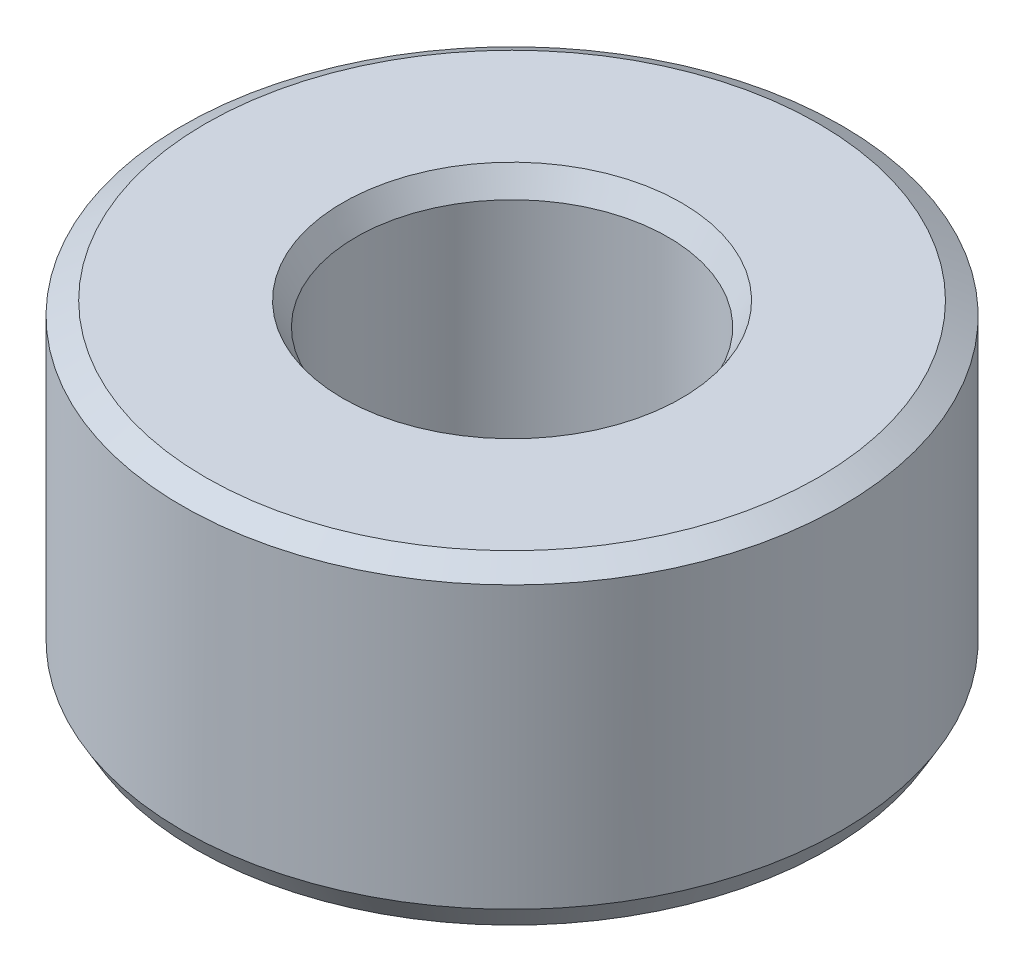
ISO-10303-21;
HEADER;
FILE_DESCRIPTION(('STEP AP214'),'2;1');
FILE_NAME('part.step','',(''),(''),'','','');
FILE_SCHEMA(('AUTOMOTIVE_DESIGN { 1 0 10303 214 1 1 1 1 }'));
ENDSEC;
DATA;
#1=APPLICATION_CONTEXT('core data for automotive mechanical design processes');
#2=APPLICATION_PROTOCOL_DEFINITION('international standard','automotive_design',2000,#1);
#3=PRODUCT_CONTEXT('',#1,'mechanical');
#4=PRODUCT('Part','Part','',(#3));
#5=PRODUCT_RELATED_PRODUCT_CATEGORY('part','',(#4));
#6=PRODUCT_DEFINITION_FORMATION('','',#4);
#7=PRODUCT_DEFINITION_CONTEXT('part definition',#1,'design');
#8=PRODUCT_DEFINITION('design','',#6,#7);
#9=PRODUCT_DEFINITION_SHAPE('','',#8);
#10=(LENGTH_UNIT() NAMED_UNIT(*) SI_UNIT(.MILLI.,.METRE.));
#11=(NAMED_UNIT(*) PLANE_ANGLE_UNIT() SI_UNIT($,.RADIAN.));
#12=(NAMED_UNIT(*) SI_UNIT($,.STERADIAN.) SOLID_ANGLE_UNIT());
#13=UNCERTAINTY_MEASURE_WITH_UNIT(LENGTH_MEASURE(1.E-05),#10,'distance_accuracy_value','');
#14=(GEOMETRIC_REPRESENTATION_CONTEXT(3) GLOBAL_UNCERTAINTY_ASSIGNED_CONTEXT((#13)) GLOBAL_UNIT_ASSIGNED_CONTEXT((#10,
#11,#12)) REPRESENTATION_CONTEXT('',''));
#15=CARTESIAN_POINT('',(0.,0.,0.));
#16=DIRECTION('',(0.,0.,1.));
#17=DIRECTION('',(1.,0.,0.));
#18=AXIS2_PLACEMENT_3D('',#15,#16,#17);
#19=CARTESIAN_POINT('',(0.,16.8537695284907,0.));
#20=DIRECTION('',(0.,-1.,0.));
#21=DIRECTION('',(0.,0.,-1.));
#22=AXIS2_PLACEMENT_3D('',#19,#20,#21);
#23=CYLINDRICAL_SURFACE('',#22,17.5);
#24=CARTESIAN_POINT('',(0.,1.22643395726102,0.));
#25=DIRECTION('',(0.,1.,0.));
#26=DIRECTION('',(0.,0.,1.));
#27=AXIS2_PLACEMENT_3D('',#24,#25,#26);
#28=CIRCLE('',#27,17.5);
#29=CARTESIAN_POINT('',(0.,1.22643395726102,17.5));
#30=VERTEX_POINT('',#29);
#31=EDGE_CURVE('E10',#30,#30,#28,.T.);
#32=ORIENTED_EDGE('',*,*,#31,.T.);
#33=EDGE_LOOP('',(#32));
#34=FACE_BOUND('',#33,.T.);
#35=CARTESIAN_POINT('',(0.,16.1456875531227,0.));
#36=DIRECTION('',(0.,1.,0.));
#37=DIRECTION('',(0.,0.,1.));
#38=AXIS2_PLACEMENT_3D('',#35,#36,#37);
#39=CIRCLE('',#38,17.5);
#40=CARTESIAN_POINT('',(0.,16.1456875531227,-17.5));
#41=VERTEX_POINT('',#40);
#42=EDGE_CURVE('E50',#41,#41,#39,.F.);
#43=ORIENTED_EDGE('',*,*,#42,.T.);
#44=EDGE_LOOP('',(#43));
#45=FACE_BOUND('',#44,.T.);
#46=ADVANCED_FACE('F39',(#34,#45),#23,.T.);
#47=CARTESIAN_POINT('',(0.,16.8537695284907,0.));
#48=DIRECTION('',(0.,1.,0.));
#49=DIRECTION('',(0.,0.,1.));
#50=AXIS2_PLACEMENT_3D('',#47,#48,#49);
#51=PLANE('',#50);
#52=CARTESIAN_POINT('',(0.,16.8537695284907,0.));
#53=DIRECTION('',(0.,1.,0.));
#54=DIRECTION('',(0.,0.,1.));
#55=AXIS2_PLACEMENT_3D('',#52,#53,#54);
#56=CIRCLE('',#55,8.99396631471443);
#57=CARTESIAN_POINT('',(0.,16.8537695284907,8.99396631471443));
#58=VERTEX_POINT('',#57);
#59=EDGE_CURVE('E58',#58,#58,#56,.F.);
#60=ORIENTED_EDGE('',*,*,#59,.T.);
#61=EDGE_LOOP('',(#60));
#62=FACE_BOUND('',#61,.T.);
#63=CARTESIAN_POINT('',(0.,16.8537695284907,0.));
#64=DIRECTION('',(0.,1.,0.));
#65=DIRECTION('',(0.,0.,1.));
#66=AXIS2_PLACEMENT_3D('',#63,#64,#65);
#67=CIRCLE('',#66,16.273566042739);
#68=CARTESIAN_POINT('',(0.,16.8537695284906,-16.273566042739));
#69=VERTEX_POINT('',#68);
#70=EDGE_CURVE('E61',#69,#69,#67,.T.);
#71=ORIENTED_EDGE('',*,*,#70,.T.);
#72=EDGE_LOOP('',(#71));
#73=FACE_BOUND('',#72,.T.);
#74=ADVANCED_FACE('F88',(#62,#73),#51,.T.);
#75=CARTESIAN_POINT('',(0.,0.,0.));
#76=DIRECTION('',(0.,1.,0.));
#77=DIRECTION('',(0.,0.,1.));
#78=AXIS2_PLACEMENT_3D('',#75,#76,#77);
#79=PLANE('',#78);
#80=CARTESIAN_POINT('',(0.,0.,0.));
#81=DIRECTION('',(0.,1.,0.));
#82=DIRECTION('',(0.,0.,1.));
#83=AXIS2_PLACEMENT_3D('',#80,#81,#82);
#84=CIRCLE('',#83,9.5123182966075);
#85=CARTESIAN_POINT('',(0.,0.,9.5123182966075));
#86=VERTEX_POINT('',#85);
#87=EDGE_CURVE('E51',#86,#86,#84,.T.);
#88=ORIENTED_EDGE('',*,*,#87,.T.);
#89=EDGE_LOOP('',(#88));
#90=FACE_BOUND('',#89,.T.);
#91=CARTESIAN_POINT('',(0.,0.,0.));
#92=DIRECTION('',(0.,1.,0.));
#93=DIRECTION('',(0.,0.,1.));
#94=AXIS2_PLACEMENT_3D('',#91,#92,#93);
#95=CIRCLE('',#94,16.7919180246321);
#96=CARTESIAN_POINT('',(0.,0.,16.7919180246321));
#97=VERTEX_POINT('',#96);
#98=EDGE_CURVE('E54',#97,#97,#95,.F.);
#99=ORIENTED_EDGE('',*,*,#98,.T.);
#100=EDGE_LOOP('',(#99));
#101=FACE_BOUND('',#100,.T.);
#102=ADVANCED_FACE('F83',(#90,#101),#79,.F.);
#103=CARTESIAN_POINT('',(0.,16.8537695284907,0.));
#104=DIRECTION('',(0.,-1.,0.));
#105=DIRECTION('',(0.,0.,-1.));
#106=AXIS2_PLACEMENT_3D('',#103,#104,#105);
#107=CYLINDRICAL_SURFACE('',#106,8.28588433934648);
#108=CARTESIAN_POINT('',(0.,15.6273355712296,0.));
#109=DIRECTION('',(0.,1.,0.));
#110=DIRECTION('',(0.,0.,1.));
#111=AXIS2_PLACEMENT_3D('',#108,#109,#110);
#112=CIRCLE('',#111,8.28588433934648);
#113=CARTESIAN_POINT('',(0.,15.6273355712296,8.28588433934648));
#114=VERTEX_POINT('',#113);
#115=EDGE_CURVE('E67',#114,#114,#112,.T.);
#116=ORIENTED_EDGE('',*,*,#115,.T.);
#117=EDGE_LOOP('',(#116));
#118=FACE_BOUND('',#117,.T.);
#119=CARTESIAN_POINT('',(0.,0.708081975367956,0.));
#120=DIRECTION('',(0.,1.,0.));
#121=DIRECTION('',(0.,0.,1.));
#122=AXIS2_PLACEMENT_3D('',#119,#120,#121);
#123=CIRCLE('',#122,8.28588433934648);
#124=CARTESIAN_POINT('',(0.,0.708081975367956,8.28588433934648));
#125=VERTEX_POINT('',#124);
#126=EDGE_CURVE('E69',#125,#125,#123,.F.);
#127=ORIENTED_EDGE('',*,*,#126,.T.);
#128=EDGE_LOOP('',(#127));
#129=FACE_BOUND('',#128,.T.);
#130=ADVANCED_FACE('F71',(#118,#129),#107,.F.);
#131=CARTESIAN_POINT('',(0.,15.6273355712296,0.));
#132=DIRECTION('',(0.,1.,0.));
#133=DIRECTION('',(0.,0.,1.));
#134=AXIS2_PLACEMENT_3D('',#131,#132,#133);
#135=CONICAL_SURFACE('',#134,8.28588433934648,0.523598775598304);
#136=ORIENTED_EDGE('',*,*,#59,.F.);
#137=EDGE_LOOP('',(#136));
#138=FACE_BOUND('',#137,.T.);
#139=ORIENTED_EDGE('',*,*,#115,.F.);
#140=EDGE_LOOP('',(#139));
#141=FACE_BOUND('',#140,.T.);
#142=ADVANCED_FACE('F77',(#138,#141),#135,.F.);
#143=CARTESIAN_POINT('',(0.,0.,0.));
#144=DIRECTION('',(0.,-1.,0.));
#145=DIRECTION('',(0.,0.,-1.));
#146=AXIS2_PLACEMENT_3D('',#143,#144,#145);
#147=CONICAL_SURFACE('',#146,9.5123182966075,1.04719755119659);
#148=ORIENTED_EDGE('',*,*,#126,.F.);
#149=EDGE_LOOP('',(#148));
#150=FACE_BOUND('',#149,.T.);
#151=ORIENTED_EDGE('',*,*,#87,.F.);
#152=EDGE_LOOP('',(#151));
#153=FACE_BOUND('',#152,.T.);
#154=ADVANCED_FACE('F73',(#150,#153),#147,.F.);
#155=CARTESIAN_POINT('',(0.,1.22643395726102,0.));
#156=DIRECTION('',(0.,1.,0.));
#157=DIRECTION('',(0.,0.,1.));
#158=AXIS2_PLACEMENT_3D('',#155,#156,#157);
#159=CONICAL_SURFACE('',#158,17.5,0.5235987755983);
#160=ORIENTED_EDGE('',*,*,#98,.F.);
#161=EDGE_LOOP('',(#160));
#162=FACE_BOUND('',#161,.T.);
#163=ORIENTED_EDGE('',*,*,#31,.F.);
#164=EDGE_LOOP('',(#163));
#165=FACE_BOUND('',#164,.T.);
#166=ADVANCED_FACE('F76',(#162,#165),#159,.T.);
#167=CARTESIAN_POINT('',(0.,16.8537695284907,0.));
#168=DIRECTION('',(0.,-1.,0.));
#169=DIRECTION('',(0.,0.,-1.));
#170=AXIS2_PLACEMENT_3D('',#167,#168,#169);
#171=CONICAL_SURFACE('',#170,16.273566042739,1.04719755119659);
#172=CARTESIAN_POINT('',(0.,16.1456875531227,-17.5));
#173=CARTESIAN_POINT('',(0.,16.1530634070328,-17.4872246462785));
#174=CARTESIAN_POINT('',(0.,16.1604392609429,-17.4744492925571));
#175=CARTESIAN_POINT('',(0.,16.175190968763,-17.4488985851141));
#176=CARTESIAN_POINT('',(0.,16.1825668226731,-17.4361232313927));
#177=CARTESIAN_POINT('',(0.,16.1973185304933,-17.4105725239497));
#178=CARTESIAN_POINT('',(0.,16.2046943844034,-17.3977971702283));
#179=CARTESIAN_POINT('',(0.,16.2194460922235,-17.3722464627853));
#180=CARTESIAN_POINT('',(0.,16.2268219461336,-17.3594711090639));
#181=CARTESIAN_POINT('',(0.,16.2415736539538,-17.3339204016209));
#182=CARTESIAN_POINT('',(0.,16.2489495078639,-17.3211450478994));
#183=CARTESIAN_POINT('',(0.,16.263701215684,-17.2955943404565));
#184=CARTESIAN_POINT('',(0.,16.2710770695941,-17.282818986735));
#185=CARTESIAN_POINT('',(0.,16.2858287774143,-17.2572682792921));
#186=CARTESIAN_POINT('',(0.,16.2932046313244,-17.2444929255706));
#187=CARTESIAN_POINT('',(0.,16.3079563391445,-17.2189422181277));
#188=CARTESIAN_POINT('',(0.,16.3153321930546,-17.2061668644062));
#189=CARTESIAN_POINT('',(0.,16.3300839008748,-17.1806161569633));
#190=CARTESIAN_POINT('',(0.,16.3374597547849,-17.1678408032418));
#191=CARTESIAN_POINT('',(0.,16.352211462605,-17.1422900957989));
#192=CARTESIAN_POINT('',(0.,16.3595873165151,-17.1295147420774));
#193=CARTESIAN_POINT('',(0.,16.3743390243353,-17.1039640346345));
#194=CARTESIAN_POINT('',(0.,16.3817148782454,-17.091188680913));
#195=CARTESIAN_POINT('',(0.,16.3964665860655,-17.0656379734701));
#196=CARTESIAN_POINT('',(0.,16.4038424399756,-17.0528626197486));
#197=CARTESIAN_POINT('',(0.,16.4185941477958,-17.0273119123057));
#198=CARTESIAN_POINT('',(0.,16.4259700017058,-17.0145365585842));
#199=CARTESIAN_POINT('',(0.,16.440721709526,-16.9889858511413));
#200=CARTESIAN_POINT('',(0.,16.4480975634361,-16.9762104974198));
#201=CARTESIAN_POINT('',(0.,16.4628492712563,-16.9506597899768));
#202=CARTESIAN_POINT('',(0.,16.4702251251663,-16.9378844362554));
#203=CARTESIAN_POINT('',(0.,16.4849768329865,-16.9123337288124));
#204=CARTESIAN_POINT('',(0.,16.4923526868966,-16.899558375091));
#205=CARTESIAN_POINT('',(0.,16.5071043947168,-16.874007667648));
#206=CARTESIAN_POINT('',(0.,16.5144802486268,-16.8612323139266));
#207=CARTESIAN_POINT('',(0.,16.529231956447,-16.8356816064836));
#208=CARTESIAN_POINT('',(0.,16.5366078103571,-16.8229062527622));
#209=CARTESIAN_POINT('',(0.,16.5513595181773,-16.7973555453192));
#210=CARTESIAN_POINT('',(0.,16.5587353720873,-16.7845801915977));
#211=CARTESIAN_POINT('',(0.,16.5734870799075,-16.7590294841548));
#212=CARTESIAN_POINT('',(0.,16.5808629338176,-16.7462541304333));
#213=CARTESIAN_POINT('',(0.,16.5956146416377,-16.7207034229904));
#214=CARTESIAN_POINT('',(0.,16.6029904955478,-16.7079280692689));
#215=CARTESIAN_POINT('',(0.,16.617742203368,-16.682377361826));
#216=CARTESIAN_POINT('',(0.,16.6251180572781,-16.6696020081045));
#217=CARTESIAN_POINT('',(0.,16.6398697650982,-16.6440513006616));
#218=CARTESIAN_POINT('',(0.,16.6472456190083,-16.6312759469401));
#219=CARTESIAN_POINT('',(0.,16.6619973268285,-16.6057252394972));
#220=CARTESIAN_POINT('',(0.,16.6693731807386,-16.5929498857757));
#221=CARTESIAN_POINT('',(0.,16.6841248885587,-16.5673991783328));
#222=CARTESIAN_POINT('',(0.,16.6915007424688,-16.5546238246113));
#223=CARTESIAN_POINT('',(0.,16.706252450289,-16.5290731171684));
#224=CARTESIAN_POINT('',(0.,16.7136283041991,-16.5162977634469));
#225=CARTESIAN_POINT('',(0.,16.7283800120192,-16.490747056004));
#226=CARTESIAN_POINT('',(0.,16.7357558659293,-16.4779717022825));
#227=CARTESIAN_POINT('',(0.,16.7505075737495,-16.4524209948396));
#228=CARTESIAN_POINT('',(0.,16.7578834276596,-16.4396456411181));
#229=CARTESIAN_POINT('',(0.,16.7726351354797,-16.4140949336752));
#230=CARTESIAN_POINT('',(0.,16.7800109893898,-16.4013195799537));
#231=CARTESIAN_POINT('',(0.,16.79476269721,-16.3757688725107));
#232=CARTESIAN_POINT('',(0.,16.8021385511201,-16.3629935187893));
#233=CARTESIAN_POINT('',(0.,16.8168902589402,-16.3374428113463));
#234=CARTESIAN_POINT('',(0.,16.8242661128503,-16.3246674576249));
#235=CARTESIAN_POINT('',(0.,16.8390178206705,-16.2991167501819));
#236=CARTESIAN_POINT('',(0.,16.8463936745806,-16.2863413964605));
#237=CARTESIAN_POINT('',(0.,16.8537695284907,-16.273566042739));
#238=B_SPLINE_CURVE_WITH_KNOTS('',3,(#172,#173,#174,#175,#176,#177,#178,#179,#180,#181,#182,
#183,#184,#185,#186,#187,#188,#189,#190,#191,#192,#193,#194,#195,#196,#197,#198,#199,#200,#201,
#202,#203,#204,#205,#206,#207,#208,#209,#210,#211,#212,#213,#214,#215,#216,#217,#218,#219,#220,
#221,#222,#223,#224,#225,#226,#227,#228,#229,#230,#231,#232,#233,#234,#235,#236,#237),
.UNSPECIFIED.,.F.,.F.,(4,2,2,2,2,2,2,2,2,2,2,2,2,2,2,2,2,2,2,2,2,2,2,2,2,2,2,2,2,2,2,2,4),(0.,
0.0442551234604957,0.0885102469209944,0.13276537038149,0.177020493841987,0.221275617302483,
0.265530740762982,0.309785864223477,0.354040987683974,0.39829611114447,0.442551234604969,
0.486806358065465,0.531061481525962,0.575316604986457,0.619571728446956,0.663826851907452,
0.708081975367949,0.752337098828444,0.79659222228894,0.840847345749439,0.885102469209933,
0.929357592670432,0.973612716130927,1.01786783959143,1.06212296305192,1.10637808651242,
1.15063320997291,1.19488833343341,1.23914345689391,1.28339858035441,1.3276537038149,
1.3719088272754,1.4161639507359),.UNSPECIFIED.);
#239=EDGE_CURVE('BSEAM45',#41,#69,#238,.T.);
#240=ORIENTED_EDGE('',*,*,#42,.F.);
#241=ORIENTED_EDGE('',*,*,#70,.F.);
#242=ORIENTED_EDGE('',*,*,#239,.T.);
#243=ORIENTED_EDGE('',*,*,#239,.F.);
#244=EDGE_LOOP('',(#240,#242,#241,#243));
#245=FACE_BOUND('',#244,.T.);
#246=ADVANCED_FACE('F45',(#245),#171,.T.);
#247=CLOSED_SHELL('',(#46,#74,#102,#130,#142,#154,#166,#246));
#248=MANIFOLD_SOLID_BREP('B2',#247);
#249=ADVANCED_BREP_SHAPE_REPRESENTATION('',(#18,#248),#14);
#250=SHAPE_DEFINITION_REPRESENTATION(#9,#249);
ENDSEC;
END-ISO-10303-21;
